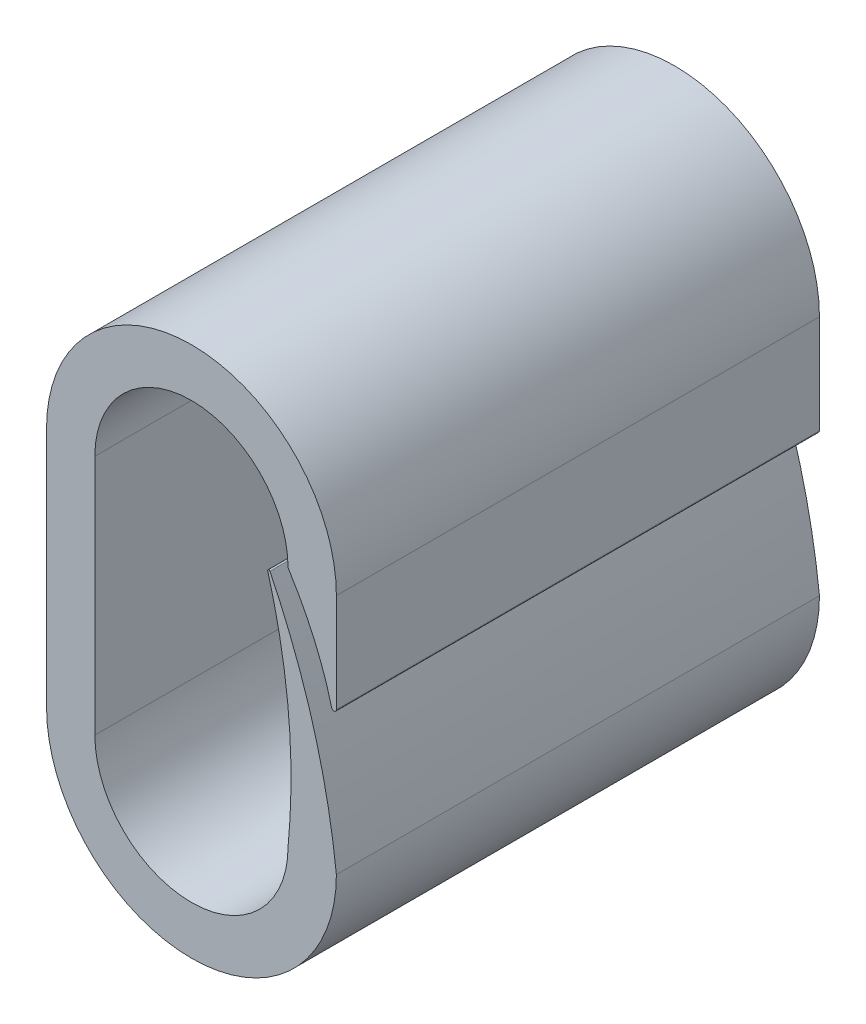
ISO-10303-21;
HEADER;
FILE_DESCRIPTION(('STEP AP214'),'2;1');
FILE_NAME('part.step','',(''),(''),'','','');
FILE_SCHEMA(('AUTOMOTIVE_DESIGN { 1 0 10303 214 1 1 1 1 }'));
ENDSEC;
DATA;
#1=APPLICATION_CONTEXT('core data for automotive mechanical design processes');
#2=APPLICATION_PROTOCOL_DEFINITION('international standard','automotive_design',2000,#1);
#3=PRODUCT_CONTEXT('',#1,'mechanical');
#4=PRODUCT('Part','Part','',(#3));
#5=PRODUCT_RELATED_PRODUCT_CATEGORY('part','',(#4));
#6=PRODUCT_DEFINITION_FORMATION('','',#4);
#7=PRODUCT_DEFINITION_CONTEXT('part definition',#1,'design');
#8=PRODUCT_DEFINITION('design','',#6,#7);
#9=PRODUCT_DEFINITION_SHAPE('','',#8);
#10=(LENGTH_UNIT() NAMED_UNIT(*) SI_UNIT(.MILLI.,.METRE.));
#11=(NAMED_UNIT(*) PLANE_ANGLE_UNIT() SI_UNIT($,.RADIAN.));
#12=(NAMED_UNIT(*) SI_UNIT($,.STERADIAN.) SOLID_ANGLE_UNIT());
#13=UNCERTAINTY_MEASURE_WITH_UNIT(LENGTH_MEASURE(1.E-05),#10,'distance_accuracy_value','');
#14=(GEOMETRIC_REPRESENTATION_CONTEXT(3) GLOBAL_UNCERTAINTY_ASSIGNED_CONTEXT((#13)) GLOBAL_UNIT_ASSIGNED_CONTEXT((#10,
#11,#12)) REPRESENTATION_CONTEXT('',''));
#15=CARTESIAN_POINT('',(0.,0.,0.));
#16=DIRECTION('',(0.,0.,1.));
#17=DIRECTION('',(1.,0.,0.));
#18=AXIS2_PLACEMENT_3D('',#15,#16,#17);
#19=CARTESIAN_POINT('',(-3.,0.,10.));
#20=DIRECTION('',(-1.,0.,0.));
#21=DIRECTION('',(0.,0.,1.));
#22=AXIS2_PLACEMENT_3D('',#19,#20,#21);
#23=PLANE('',#22);
#24=DIRECTION('',(0.,1.,0.));
#25=VECTOR('',#24,1.);
#26=CARTESIAN_POINT('',(-3.,0.,0.));
#27=LINE('',#26,#25);
#28=CARTESIAN_POINT('',(-3.,-2.5,0.));
#29=VERTEX_POINT('',#28);
#30=CARTESIAN_POINT('',(-3.,2.5,0.));
#31=VERTEX_POINT('',#30);
#32=EDGE_CURVE('E136',#29,#31,#27,.T.);
#33=ORIENTED_EDGE('',*,*,#32,.F.);
#34=DIRECTION('',(0.,0.,-1.));
#35=VECTOR('',#34,1.);
#36=CARTESIAN_POINT('',(-3.,-2.5,10.));
#37=LINE('',#36,#35);
#38=CARTESIAN_POINT('',(-3.,-2.5,10.));
#39=VERTEX_POINT('',#38);
#40=EDGE_CURVE('E131',#39,#29,#37,.T.);
#41=ORIENTED_EDGE('',*,*,#40,.F.);
#42=DIRECTION('',(0.,1.,0.));
#43=VECTOR('',#42,1.);
#44=CARTESIAN_POINT('',(-3.,0.,10.));
#45=LINE('',#44,#43);
#46=CARTESIAN_POINT('',(-3.,2.5,10.));
#47=VERTEX_POINT('',#46);
#48=EDGE_CURVE('E134',#39,#47,#45,.T.);
#49=ORIENTED_EDGE('',*,*,#48,.T.);
#50=DIRECTION('',(0.,0.,-1.));
#51=VECTOR('',#50,1.);
#52=CARTESIAN_POINT('',(-3.,2.5,10.));
#53=LINE('',#52,#51);
#54=EDGE_CURVE('E242',#47,#31,#53,.T.);
#55=ORIENTED_EDGE('',*,*,#54,.T.);
#56=EDGE_LOOP('',(#33,#41,#49,#55));
#57=FACE_BOUND('',#56,.T.);
#58=ADVANCED_FACE('F41',(#57),#23,.T.);
#59=CARTESIAN_POINT('',(0.,-2.5,10.));
#60=DIRECTION('',(0.,0.,-1.));
#61=DIRECTION('',(-1.,0.,0.));
#62=AXIS2_PLACEMENT_3D('',#59,#60,#61);
#63=CYLINDRICAL_SURFACE('',#62,3.);
#64=CARTESIAN_POINT('',(0.,-2.5,0.));
#65=DIRECTION('',(0.,0.,1.));
#66=DIRECTION('',(1.,0.,0.));
#67=AXIS2_PLACEMENT_3D('',#64,#65,#66);
#68=CIRCLE('',#67,3.);
#69=CARTESIAN_POINT('',(3.,-2.5,0.));
#70=VERTEX_POINT('',#69);
#71=EDGE_CURVE('E282',#29,#70,#68,.T.);
#72=ORIENTED_EDGE('',*,*,#71,.T.);
#73=DIRECTION('',(0.,0.,-1.));
#74=VECTOR('',#73,1.);
#75=CARTESIAN_POINT('',(3.,-2.5,10.));
#76=LINE('',#75,#74);
#77=CARTESIAN_POINT('',(3.,-2.5,10.));
#78=VERTEX_POINT('',#77);
#79=EDGE_CURVE('E141',#78,#70,#76,.T.);
#80=ORIENTED_EDGE('',*,*,#79,.F.);
#81=CARTESIAN_POINT('',(0.,-2.5,10.));
#82=DIRECTION('',(0.,0.,1.));
#83=DIRECTION('',(1.,0.,0.));
#84=AXIS2_PLACEMENT_3D('',#81,#82,#83);
#85=CIRCLE('',#84,3.);
#86=EDGE_CURVE('E144',#39,#78,#85,.T.);
#87=ORIENTED_EDGE('',*,*,#86,.F.);
#88=ORIENTED_EDGE('',*,*,#40,.T.);
#89=EDGE_LOOP('',(#72,#80,#87,#88));
#90=FACE_BOUND('',#89,.T.);
#91=ADVANCED_FACE('F145',(#90),#63,.T.);
#92=CARTESIAN_POINT('',(3.,-2.5,10.));
#93=CARTESIAN_POINT('',(2.70940264920965,0.136566945136731,10.));
#94=CARTESIAN_POINT('',(1.5,2.5,10.));
#95=B_SPLINE_CURVE_WITH_KNOTS('',2,(#92,#93,#94),.UNSPECIFIED.,.F.,.F.,(3,3),(0.,1.),.UNSPECIFIED.);
#96=DIRECTION('',(0.,0.,-1.));
#97=VECTOR('',#96,1.);
#98=SURFACE_OF_LINEAR_EXTRUSION('',#95,#97);
#99=CARTESIAN_POINT('',(3.,-2.5,0.));
#100=CARTESIAN_POINT('',(2.70940264920965,0.136566945136731,0.));
#101=CARTESIAN_POINT('',(1.5,2.5,0.));
#102=B_SPLINE_CURVE_WITH_KNOTS('',2,(#99,#100,#101),.UNSPECIFIED.,.F.,.F.,(3,3),(0.,1.),.UNSPECIFIED.);
#103=CARTESIAN_POINT('',(1.62476606540839,2.25044931566098,0.));
#104=VERTEX_POINT('',#103);
#105=EDGE_CURVE('E273',#70,#104,#102,.T.);
#106=ORIENTED_EDGE('',*,*,#105,.T.);
#107=DIRECTION('',(0.,0.,-1.));
#108=VECTOR('',#107,1.);
#109=CARTESIAN_POINT('',(1.62476606540839,2.25044931566098,0.));
#110=LINE('',#109,#108);
#111=CARTESIAN_POINT('',(1.62476606540839,2.25044931566098,10.));
#112=VERTEX_POINT('',#111);
#113=EDGE_CURVE('E203',#104,#112,#110,.F.);
#114=ORIENTED_EDGE('',*,*,#113,.T.);
#115=EDGE_CURVE('E151',#78,#112,#95,.T.);
#116=ORIENTED_EDGE('',*,*,#115,.F.);
#117=ORIENTED_EDGE('',*,*,#79,.T.);
#118=EDGE_LOOP('',(#106,#114,#116,#117));
#119=FACE_BOUND('',#118,.T.);
#120=ADVANCED_FACE('F179',(#119),#98,.F.);
#121=CARTESIAN_POINT('',(2.,-2.5,10.));
#122=CARTESIAN_POINT('',(2.24514516892273,0.0490290337845471,10.));
#123=CARTESIAN_POINT('',(1.5,2.5,10.));
#124=B_SPLINE_CURVE_WITH_KNOTS('',2,(#121,#122,#123),.UNSPECIFIED.,.F.,.F.,(3,3),(0.,1.),.UNSPECIFIED.);
#125=DIRECTION('',(0.,0.,-1.));
#126=VECTOR('',#125,1.);
#127=SURFACE_OF_LINEAR_EXTRUSION('',#124,#126);
#128=CARTESIAN_POINT('',(2.,-2.5,10.));
#129=VERTEX_POINT('',#128);
#130=CARTESIAN_POINT('',(1.57823574852795,2.23270808205307,10.));
#131=VERTEX_POINT('',#130);
#132=EDGE_CURVE('E170',#129,#131,#124,.T.);
#133=ORIENTED_EDGE('',*,*,#132,.T.);
#134=DIRECTION('',(0.,0.,-1.));
#135=VECTOR('',#134,1.);
#136=CARTESIAN_POINT('',(1.57823574852795,2.23270808205307,10.));
#137=LINE('',#136,#135);
#138=CARTESIAN_POINT('',(1.57823574852795,2.23270808205307,0.));
#139=VERTEX_POINT('',#138);
#140=EDGE_CURVE('E140',#131,#139,#137,.T.);
#141=ORIENTED_EDGE('',*,*,#140,.T.);
#142=CARTESIAN_POINT('',(2.,-2.5,0.));
#143=CARTESIAN_POINT('',(2.24514516892273,0.0490290337845471,0.));
#144=CARTESIAN_POINT('',(1.5,2.5,0.));
#145=B_SPLINE_CURVE_WITH_KNOTS('',2,(#142,#143,#144),.UNSPECIFIED.,.F.,.F.,(3,3),(0.,1.),.UNSPECIFIED.);
#146=CARTESIAN_POINT('',(2.,-2.5,0.));
#147=VERTEX_POINT('',#146);
#148=EDGE_CURVE('E267',#147,#139,#145,.T.);
#149=ORIENTED_EDGE('',*,*,#148,.F.);
#150=DIRECTION('',(0.,0.,-1.));
#151=VECTOR('',#150,1.);
#152=CARTESIAN_POINT('',(2.,-2.5,10.));
#153=LINE('',#152,#151);
#154=EDGE_CURVE('E226',#129,#147,#153,.T.);
#155=ORIENTED_EDGE('',*,*,#154,.F.);
#156=EDGE_LOOP('',(#133,#141,#149,#155));
#157=FACE_BOUND('',#156,.T.);
#158=ADVANCED_FACE('F183',(#157),#127,.T.);
#159=CARTESIAN_POINT('',(0.,-2.5,10.));
#160=DIRECTION('',(0.,0.,-1.));
#161=DIRECTION('',(-1.,0.,0.));
#162=AXIS2_PLACEMENT_3D('',#159,#160,#161);
#163=CYLINDRICAL_SURFACE('',#162,2.);
#164=CARTESIAN_POINT('',(0.,-2.5,0.));
#165=DIRECTION('',(0.,0.,1.));
#166=DIRECTION('',(1.,0.,0.));
#167=AXIS2_PLACEMENT_3D('',#164,#165,#166);
#168=CIRCLE('',#167,2.);
#169=CARTESIAN_POINT('',(-2.,-2.5,0.));
#170=VERTEX_POINT('',#169);
#171=EDGE_CURVE('E263',#170,#147,#168,.T.);
#172=ORIENTED_EDGE('',*,*,#171,.F.);
#173=DIRECTION('',(0.,0.,-1.));
#174=VECTOR('',#173,1.);
#175=CARTESIAN_POINT('',(-2.,-2.5,10.));
#176=LINE('',#175,#174);
#177=CARTESIAN_POINT('',(-2.,-2.5,10.));
#178=VERTEX_POINT('',#177);
#179=EDGE_CURVE('E229',#178,#170,#176,.T.);
#180=ORIENTED_EDGE('',*,*,#179,.F.);
#181=CARTESIAN_POINT('',(0.,-2.5,10.));
#182=DIRECTION('',(0.,0.,1.));
#183=DIRECTION('',(1.,0.,0.));
#184=AXIS2_PLACEMENT_3D('',#181,#182,#183);
#185=CIRCLE('',#184,2.);
#186=EDGE_CURVE('E339',#178,#129,#185,.T.);
#187=ORIENTED_EDGE('',*,*,#186,.T.);
#188=ORIENTED_EDGE('',*,*,#154,.T.);
#189=EDGE_LOOP('',(#172,#180,#187,#188));
#190=FACE_BOUND('',#189,.T.);
#191=ADVANCED_FACE('F319',(#190),#163,.F.);
#192=CARTESIAN_POINT('',(-2.,0.,10.));
#193=DIRECTION('',(-1.,0.,0.));
#194=DIRECTION('',(0.,-1.,0.));
#195=AXIS2_PLACEMENT_3D('',#192,#193,#194);
#196=PLANE('',#195);
#197=DIRECTION('',(0.,1.,0.));
#198=VECTOR('',#197,1.);
#199=CARTESIAN_POINT('',(-2.,0.,0.));
#200=LINE('',#199,#198);
#201=CARTESIAN_POINT('',(-2.,2.5,0.));
#202=VERTEX_POINT('',#201);
#203=EDGE_CURVE('E259',#170,#202,#200,.T.);
#204=ORIENTED_EDGE('',*,*,#203,.T.);
#205=DIRECTION('',(0.,0.,-1.));
#206=VECTOR('',#205,1.);
#207=CARTESIAN_POINT('',(-2.,2.5,10.));
#208=LINE('',#207,#206);
#209=CARTESIAN_POINT('',(-2.,2.5,10.));
#210=VERTEX_POINT('',#209);
#211=EDGE_CURVE('E232',#210,#202,#208,.T.);
#212=ORIENTED_EDGE('',*,*,#211,.F.);
#213=DIRECTION('',(0.,1.,0.));
#214=VECTOR('',#213,1.);
#215=CARTESIAN_POINT('',(-2.,0.,10.));
#216=LINE('',#215,#214);
#217=EDGE_CURVE('E335',#178,#210,#216,.T.);
#218=ORIENTED_EDGE('',*,*,#217,.F.);
#219=ORIENTED_EDGE('',*,*,#179,.T.);
#220=EDGE_LOOP('',(#204,#212,#218,#219));
#221=FACE_BOUND('',#220,.T.);
#222=ADVANCED_FACE('F316',(#221),#196,.F.);
#223=CARTESIAN_POINT('',(0.,2.5,10.));
#224=DIRECTION('',(0.,0.,-1.));
#225=DIRECTION('',(-1.,0.,0.));
#226=AXIS2_PLACEMENT_3D('',#223,#224,#225);
#227=CYLINDRICAL_SURFACE('',#226,2.);
#228=CARTESIAN_POINT('',(0.,2.5,0.));
#229=DIRECTION('',(0.,0.,1.));
#230=DIRECTION('',(1.,0.,0.));
#231=AXIS2_PLACEMENT_3D('',#228,#229,#230);
#232=CIRCLE('',#231,2.);
#233=CARTESIAN_POINT('',(2.,2.5,0.));
#234=VERTEX_POINT('',#233);
#235=EDGE_CURVE('E252',#234,#202,#232,.T.);
#236=ORIENTED_EDGE('',*,*,#235,.F.);
#237=DIRECTION('',(0.,0.,-1.));
#238=VECTOR('',#237,1.);
#239=CARTESIAN_POINT('',(2.,2.5,10.));
#240=LINE('',#239,#238);
#241=CARTESIAN_POINT('',(2.,2.5,10.));
#242=VERTEX_POINT('',#241);
#243=EDGE_CURVE('E235',#242,#234,#240,.T.);
#244=ORIENTED_EDGE('',*,*,#243,.F.);
#245=CARTESIAN_POINT('',(0.,2.5,10.));
#246=DIRECTION('',(0.,0.,1.));
#247=DIRECTION('',(1.,0.,0.));
#248=AXIS2_PLACEMENT_3D('',#245,#246,#247);
#249=CIRCLE('',#248,2.);
#250=EDGE_CURVE('E301',#242,#210,#249,.T.);
#251=ORIENTED_EDGE('',*,*,#250,.T.);
#252=ORIENTED_EDGE('',*,*,#211,.T.);
#253=EDGE_LOOP('',(#236,#244,#251,#252));
#254=FACE_BOUND('',#253,.T.);
#255=ADVANCED_FACE('F312',(#254),#227,.F.);
#256=CARTESIAN_POINT('',(2.,2.5,10.));
#257=CARTESIAN_POINT('',(3.46423834544263,0.185695338177052,10.));
#258=CARTESIAN_POINT('',(3.,-2.5,10.));
#259=B_SPLINE_CURVE_WITH_KNOTS('',2,(#256,#257,#258),.UNSPECIFIED.,.F.,.F.,(3,3),(0.,1.),.UNSPECIFIED.);
#260=DIRECTION('',(0.,0.,-1.));
#261=VECTOR('',#260,1.);
#262=SURFACE_OF_LINEAR_EXTRUSION('',#259,#261);
#263=CARTESIAN_POINT('',(2.,2.5,0.));
#264=CARTESIAN_POINT('',(3.46423834544263,0.185695338177052,0.));
#265=CARTESIAN_POINT('',(3.,-2.5,0.));
#266=B_SPLINE_CURVE_WITH_KNOTS('',2,(#263,#264,#265),.UNSPECIFIED.,.F.,.F.,(3,3),(0.,1.),.UNSPECIFIED.);
#267=CARTESIAN_POINT('',(2.90157799249048,0.445275208541489,0.));
#268=VERTEX_POINT('',#267);
#269=EDGE_CURVE('E247',#234,#268,#266,.T.);
#270=ORIENTED_EDGE('',*,*,#269,.T.);
#271=DIRECTION('',(0.,0.,-1.));
#272=VECTOR('',#271,1.);
#273=CARTESIAN_POINT('',(2.90157799249048,0.445275208541489,0.));
#274=LINE('',#273,#272);
#275=CARTESIAN_POINT('',(2.90157799249048,0.445275208541489,10.));
#276=VERTEX_POINT('',#275);
#277=EDGE_CURVE('E50',#268,#276,#274,.F.);
#278=ORIENTED_EDGE('',*,*,#277,.T.);
#279=EDGE_CURVE('E295',#242,#276,#259,.T.);
#280=ORIENTED_EDGE('',*,*,#279,.F.);
#281=ORIENTED_EDGE('',*,*,#243,.T.);
#282=EDGE_LOOP('',(#270,#278,#280,#281));
#283=FACE_BOUND('',#282,.T.);
#284=ADVANCED_FACE('F307',(#283),#262,.F.);
#285=CARTESIAN_POINT('',(3.,0.,10.));
#286=DIRECTION('',(-1.,0.,0.));
#287=DIRECTION('',(0.,-1.,0.));
#288=AXIS2_PLACEMENT_3D('',#285,#286,#287);
#289=PLANE('',#288);
#290=DIRECTION('',(0.,1.,0.));
#291=VECTOR('',#290,1.);
#292=CARTESIAN_POINT('',(3.,0.,10.));
#293=LINE('',#292,#291);
#294=CARTESIAN_POINT('',(3.,0.45773751927218,10.));
#295=VERTEX_POINT('',#294);
#296=CARTESIAN_POINT('',(3.,2.5,10.));
#297=VERTEX_POINT('',#296);
#298=EDGE_CURVE('E292',#295,#297,#293,.T.);
#299=ORIENTED_EDGE('',*,*,#298,.F.);
#300=DIRECTION('',(0.,0.,-1.));
#301=VECTOR('',#300,1.);
#302=CARTESIAN_POINT('',(3.,0.45773751927218,10.));
#303=LINE('',#302,#301);
#304=CARTESIAN_POINT('',(3.,0.45773751927218,0.));
#305=VERTEX_POINT('',#304);
#306=EDGE_CURVE('E208',#295,#305,#303,.T.);
#307=ORIENTED_EDGE('',*,*,#306,.T.);
#308=DIRECTION('',(0.,1.,0.));
#309=VECTOR('',#308,1.);
#310=CARTESIAN_POINT('',(3.,0.,0.));
#311=LINE('',#310,#309);
#312=CARTESIAN_POINT('',(3.,2.5,0.));
#313=VERTEX_POINT('',#312);
#314=EDGE_CURVE('E162',#305,#313,#311,.T.);
#315=ORIENTED_EDGE('',*,*,#314,.T.);
#316=DIRECTION('',(0.,0.,-1.));
#317=VECTOR('',#316,1.);
#318=CARTESIAN_POINT('',(3.,2.5,10.));
#319=LINE('',#318,#317);
#320=EDGE_CURVE('E238',#297,#313,#319,.T.);
#321=ORIENTED_EDGE('',*,*,#320,.F.);
#322=EDGE_LOOP('',(#299,#307,#315,#321));
#323=FACE_BOUND('',#322,.T.);
#324=ADVANCED_FACE('F311',(#323),#289,.F.);
#325=CARTESIAN_POINT('',(0.,2.5,10.));
#326=DIRECTION('',(0.,0.,-1.));
#327=DIRECTION('',(-1.,0.,0.));
#328=AXIS2_PLACEMENT_3D('',#325,#326,#327);
#329=CYLINDRICAL_SURFACE('',#328,3.);
#330=CARTESIAN_POINT('',(0.,2.5,0.));
#331=DIRECTION('',(0.,0.,1.));
#332=DIRECTION('',(1.,0.,0.));
#333=AXIS2_PLACEMENT_3D('',#330,#331,#332);
#334=CIRCLE('',#333,3.);
#335=EDGE_CURVE('E158',#313,#31,#334,.T.);
#336=ORIENTED_EDGE('',*,*,#335,.T.);
#337=ORIENTED_EDGE('',*,*,#54,.F.);
#338=CARTESIAN_POINT('',(0.,2.5,10.));
#339=DIRECTION('',(0.,0.,1.));
#340=DIRECTION('',(1.,0.,0.));
#341=AXIS2_PLACEMENT_3D('',#338,#339,#340);
#342=CIRCLE('',#341,3.);
#343=EDGE_CURVE('E155',#297,#47,#342,.T.);
#344=ORIENTED_EDGE('',*,*,#343,.F.);
#345=ORIENTED_EDGE('',*,*,#320,.T.);
#346=EDGE_LOOP('',(#336,#337,#344,#345));
#347=FACE_BOUND('',#346,.T.);
#348=ADVANCED_FACE('F350',(#347),#329,.T.);
#349=CARTESIAN_POINT('',(0.,0.,10.));
#350=DIRECTION('',(0.,0.,1.));
#351=DIRECTION('',(1.,0.,0.));
#352=AXIS2_PLACEMENT_3D('',#349,#350,#351);
#353=PLANE('',#352);
#354=ORIENTED_EDGE('',*,*,#279,.T.);
#355=CARTESIAN_POINT('',(2.95,0.45773751927218,10.));
#356=DIRECTION('',(0.,0.,1.));
#357=DIRECTION('',(1.,0.,0.));
#358=AXIS2_PLACEMENT_3D('',#355,#356,#357);
#359=CIRCLE('',#358,0.05);
#360=EDGE_CURVE('E11',#276,#295,#359,.T.);
#361=ORIENTED_EDGE('',*,*,#360,.T.);
#362=ORIENTED_EDGE('',*,*,#298,.T.);
#363=ORIENTED_EDGE('',*,*,#343,.T.);
#364=ORIENTED_EDGE('',*,*,#48,.F.);
#365=ORIENTED_EDGE('',*,*,#86,.T.);
#366=ORIENTED_EDGE('',*,*,#115,.T.);
#367=CARTESIAN_POINT('',(1.60230108244782,2.23948006132984,10.));
#368=DIRECTION('',(0.,0.,1.));
#369=DIRECTION('',(1.,0.,0.));
#370=AXIS2_PLACEMENT_3D('',#367,#368,#369);
#371=CIRCLE('',#370,0.025);
#372=EDGE_CURVE('E202',#112,#131,#371,.T.);
#373=ORIENTED_EDGE('',*,*,#372,.T.);
#374=ORIENTED_EDGE('',*,*,#132,.F.);
#375=ORIENTED_EDGE('',*,*,#186,.F.);
#376=ORIENTED_EDGE('',*,*,#217,.T.);
#377=ORIENTED_EDGE('',*,*,#250,.F.);
#378=EDGE_LOOP('',(#354,#361,#362,#363,#364,#365,#366,#373,#374,#375,#376,#377));
#379=FACE_BOUND('',#378,.T.);
#380=ADVANCED_FACE('F153',(#379),#353,.T.);
#381=CARTESIAN_POINT('',(0.,0.,0.));
#382=DIRECTION('',(0.,0.,1.));
#383=DIRECTION('',(1.,0.,0.));
#384=AXIS2_PLACEMENT_3D('',#381,#382,#383);
#385=PLANE('',#384);
#386=ORIENTED_EDGE('',*,*,#314,.F.);
#387=CARTESIAN_POINT('',(2.95,0.45773751927218,0.));
#388=DIRECTION('',(0.,0.,1.));
#389=DIRECTION('',(1.,0.,0.));
#390=AXIS2_PLACEMENT_3D('',#387,#388,#389);
#391=CIRCLE('',#390,0.05);
#392=EDGE_CURVE('E64',#305,#268,#391,.F.);
#393=ORIENTED_EDGE('',*,*,#392,.T.);
#394=ORIENTED_EDGE('',*,*,#269,.F.);
#395=ORIENTED_EDGE('',*,*,#235,.T.);
#396=ORIENTED_EDGE('',*,*,#203,.F.);
#397=ORIENTED_EDGE('',*,*,#171,.T.);
#398=ORIENTED_EDGE('',*,*,#148,.T.);
#399=CARTESIAN_POINT('',(1.60230108244782,2.23948006132984,0.));
#400=DIRECTION('',(0.,0.,1.));
#401=DIRECTION('',(1.,0.,0.));
#402=AXIS2_PLACEMENT_3D('',#399,#400,#401);
#403=CIRCLE('',#402,0.025);
#404=EDGE_CURVE('E214',#139,#104,#403,.F.);
#405=ORIENTED_EDGE('',*,*,#404,.T.);
#406=ORIENTED_EDGE('',*,*,#105,.F.);
#407=ORIENTED_EDGE('',*,*,#71,.F.);
#408=ORIENTED_EDGE('',*,*,#32,.T.);
#409=ORIENTED_EDGE('',*,*,#335,.F.);
#410=EDGE_LOOP('',(#386,#393,#394,#395,#396,#397,#398,#405,#406,#407,#408,#409));
#411=FACE_BOUND('',#410,.T.);
#412=ADVANCED_FACE('F191',(#411),#385,.F.);
#413=CARTESIAN_POINT('',(1.60230108244782,2.23948006132984,5.));
#414=DIRECTION('',(0.,0.,-1.));
#415=DIRECTION('',(-1.,0.,0.));
#416=AXIS2_PLACEMENT_3D('',#413,#414,#415);
#417=CYLINDRICAL_SURFACE('',#416,0.025);
#418=ORIENTED_EDGE('',*,*,#372,.F.);
#419=ORIENTED_EDGE('',*,*,#113,.F.);
#420=ORIENTED_EDGE('',*,*,#404,.F.);
#421=ORIENTED_EDGE('',*,*,#140,.F.);
#422=EDGE_LOOP('',(#418,#419,#420,#421));
#423=FACE_BOUND('',#422,.T.);
#424=ADVANCED_FACE('F189',(#423),#417,.T.);
#425=CARTESIAN_POINT('',(2.95,0.45773751927218,5.));
#426=DIRECTION('',(0.,0.,-1.));
#427=DIRECTION('',(-1.,0.,0.));
#428=AXIS2_PLACEMENT_3D('',#425,#426,#427);
#429=CYLINDRICAL_SURFACE('',#428,0.05);
#430=ORIENTED_EDGE('',*,*,#360,.F.);
#431=ORIENTED_EDGE('',*,*,#277,.F.);
#432=ORIENTED_EDGE('',*,*,#392,.F.);
#433=ORIENTED_EDGE('',*,*,#306,.F.);
#434=EDGE_LOOP('',(#430,#431,#432,#433));
#435=FACE_BOUND('',#434,.T.);
#436=ADVANCED_FACE('F43',(#435),#429,.T.);
#437=CLOSED_SHELL('',(#58,#91,#120,#158,#191,#222,#255,#284,#324,#348,#380,#412,#424,#436));
#438=MANIFOLD_SOLID_BREP('B2',#437);
#439=ADVANCED_BREP_SHAPE_REPRESENTATION('',(#18,#438),#14);
#440=SHAPE_DEFINITION_REPRESENTATION(#9,#439);
ENDSEC;
END-ISO-10303-21;
